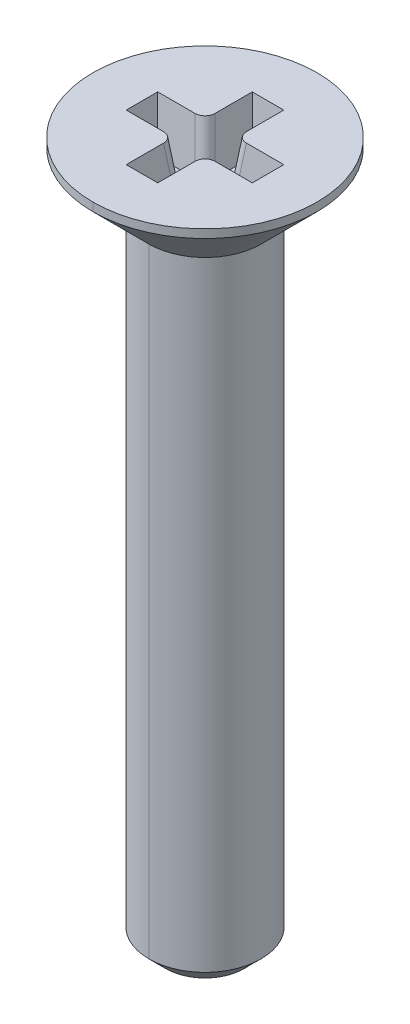
ISO-10303-21;
HEADER;
FILE_DESCRIPTION(('STEP AP214'),'2;1');
FILE_NAME('part.step','',(''),(''),'','','');
FILE_SCHEMA(('AUTOMOTIVE_DESIGN { 1 0 10303 214 1 1 1 1 }'));
ENDSEC;
DATA;
#1=APPLICATION_CONTEXT('core data for automotive mechanical design processes');
#2=APPLICATION_PROTOCOL_DEFINITION('international standard','automotive_design',2000,#1);
#3=PRODUCT_CONTEXT('',#1,'mechanical');
#4=PRODUCT('Part','Part','',(#3));
#5=PRODUCT_RELATED_PRODUCT_CATEGORY('part','',(#4));
#6=PRODUCT_DEFINITION_FORMATION('','',#4);
#7=PRODUCT_DEFINITION_CONTEXT('part definition',#1,'design');
#8=PRODUCT_DEFINITION('design','',#6,#7);
#9=PRODUCT_DEFINITION_SHAPE('','',#8);
#10=(LENGTH_UNIT() NAMED_UNIT(*) SI_UNIT(.MILLI.,.METRE.));
#11=(NAMED_UNIT(*) PLANE_ANGLE_UNIT() SI_UNIT($,.RADIAN.));
#12=(NAMED_UNIT(*) SI_UNIT($,.STERADIAN.) SOLID_ANGLE_UNIT());
#13=UNCERTAINTY_MEASURE_WITH_UNIT(LENGTH_MEASURE(1.E-05),#10,'distance_accuracy_value','');
#14=(GEOMETRIC_REPRESENTATION_CONTEXT(3) GLOBAL_UNCERTAINTY_ASSIGNED_CONTEXT((#13)) GLOBAL_UNIT_ASSIGNED_CONTEXT((#10,
#11,#12)) REPRESENTATION_CONTEXT('',''));
#15=CARTESIAN_POINT('',(0.,0.,0.));
#16=DIRECTION('',(0.,0.,1.));
#17=DIRECTION('',(1.,0.,0.));
#18=AXIS2_PLACEMENT_3D('',#15,#16,#17);
#19=CARTESIAN_POINT('',(-0.937327513708971,2.4151528831535,-0.937327513708973));
#20=DIRECTION('',(-0.120974291151355,0.985256536015293,-0.120974291151355));
#21=DIRECTION('',(0.,0.121869343405148,0.992546151641322));
#22=AXIS2_PLACEMENT_3D('',#19,#20,#21);
#23=CYLINDRICAL_SURFACE('',#22,0.358);
#24=CARTESIAN_POINT('',(-0.3427156359838,0.510000000000022,-0.698047158271395));
#25=CARTESIAN_POINT('',(-0.342715635983799,0.510000000000021,-0.489263624321907));
#26=CARTESIAN_POINT('',(-0.489263624321904,0.510000000000021,-0.342715635983802));
#27=CARTESIAN_POINT('',(-0.698047158271393,0.510000000000022,-0.342715635983802));
#28=(BOUNDED_CURVE() B_SPLINE_CURVE(3,(#24,#25,#26,#27),.UNSPECIFIED.,.F.,
.F.) B_SPLINE_CURVE_WITH_KNOTS((4,4),(2.36362083166487,3.91956447551472),
.UNSPECIFIED.) CURVE() GEOMETRIC_REPRESENTATION_ITEM() RATIONAL_B_SPLINE_CURVE((1.,
0.808225633839927,0.808225633839927,1.)) REPRESENTATION_ITEM(''));
#29=CARTESIAN_POINT('',(-0.3427156359838,0.510000000000022,-0.698047158271395));
#30=VERTEX_POINT('',#29);
#31=CARTESIAN_POINT('',(-0.698047158271393,0.510000000000022,-0.342715635983802));
#32=VERTEX_POINT('',#31);
#33=EDGE_CURVE('E354',#30,#32,#28,.T.);
#34=ORIENTED_EDGE('',*,*,#33,.F.);
#35=DIRECTION('',(0.120974291151355,-0.985256536015293,0.120974291151355));
#36=VECTOR('',#35,1.);
#37=CARTESIAN_POINT('',(-0.3375154376409,0.46764778320126,-0.692846959928494));
#38=LINE('',#37,#36);
#39=CARTESIAN_POINT('',(-0.5625,2.3,-0.917831522287595));
#40=VERTEX_POINT('',#39);
#41=EDGE_CURVE('E355',#40,#30,#38,.T.);
#42=ORIENTED_EDGE('',*,*,#41,.F.);
#43=CARTESIAN_POINT('',(-0.917831522287592,2.3,-0.5625));
#44=CARTESIAN_POINT('',(-0.709047988338105,2.30000000000002,-0.562500000000001));
#45=CARTESIAN_POINT('',(-0.562499999999999,2.30000000000002,-0.709047988338106));
#46=CARTESIAN_POINT('',(-0.5625,2.3,-0.917831522287595));
#47=(BOUNDED_CURVE() B_SPLINE_CURVE(3,(#43,#44,#45,#46),.UNSPECIFIED.,.F.,
.F.) B_SPLINE_CURVE_WITH_KNOTS((4,4),(2.36362083166487,3.91956447551472),
.UNSPECIFIED.) CURVE() GEOMETRIC_REPRESENTATION_ITEM() RATIONAL_B_SPLINE_CURVE((1.,
0.808225633839927,0.808225633839927,1.)) REPRESENTATION_ITEM(''));
#48=CARTESIAN_POINT('',(-0.917831522287592,2.3,-0.5625));
#49=VERTEX_POINT('',#48);
#50=EDGE_CURVE('E280',#49,#40,#47,.T.);
#51=ORIENTED_EDGE('',*,*,#50,.F.);
#52=DIRECTION('',(-0.120974291151355,0.985256536015293,-0.120974291151355));
#53=VECTOR('',#52,1.);
#54=CARTESIAN_POINT('',(-0.912631323944692,2.25764778320126,-0.557299801657101));
#55=LINE('',#54,#53);
#56=EDGE_CURVE('E10',#32,#49,#55,.T.);
#57=ORIENTED_EDGE('',*,*,#56,.F.);
#58=EDGE_LOOP('',(#34,#42,#51,#57));
#59=FACE_BOUND('',#58,.T.);
#60=ADVANCED_FACE('F16',(#59),#23,.T.);
#61=CARTESIAN_POINT('',(-0.871471007670894,1.87879468344341,0.871471007670896));
#62=DIRECTION('',(-0.120974291151355,0.985256536015293,0.120974291151355));
#63=DIRECTION('',(-0.992546151641322,-0.121869343405148,0.));
#64=AXIS2_PLACEMENT_3D('',#61,#62,#63);
#65=CYLINDRICAL_SURFACE('',#64,0.358);
#66=CARTESIAN_POINT('',(-0.698047158271394,0.510000000000022,0.342715635983802));
#67=CARTESIAN_POINT('',(-0.489263624321906,0.510000000000022,0.342715635983801));
#68=CARTESIAN_POINT('',(-0.342715635983801,0.510000000000022,0.489263624321906));
#69=CARTESIAN_POINT('',(-0.342715635983801,0.510000000000022,0.698047158271395));
#70=(BOUNDED_CURVE() B_SPLINE_CURVE(3,(#66,#67,#68,#69),.UNSPECIFIED.,.F.,
.F.) B_SPLINE_CURVE_WITH_KNOTS((4,4),(2.36362083166487,3.91956447551472),
.UNSPECIFIED.) CURVE() GEOMETRIC_REPRESENTATION_ITEM() RATIONAL_B_SPLINE_CURVE((1.,
0.808225633839927,0.808225633839927,1.)) REPRESENTATION_ITEM(''));
#71=CARTESIAN_POINT('',(-0.698047158271394,0.510000000000022,0.342715635983802));
#72=VERTEX_POINT('',#71);
#73=CARTESIAN_POINT('',(-0.342715635983801,0.510000000000022,0.698047158271395));
#74=VERTEX_POINT('',#73);
#75=EDGE_CURVE('E372',#72,#74,#70,.T.);
#76=ORIENTED_EDGE('',*,*,#75,.F.);
#77=DIRECTION('',(0.120974291151355,-0.985256536015293,-0.120974291151355));
#78=VECTOR('',#77,1.);
#79=CARTESIAN_POINT('',(-0.937327513708972,2.45878210809255,0.58199599142138));
#80=LINE('',#79,#78);
#81=CARTESIAN_POINT('',(-0.917831522287593,2.3,0.5625));
#82=VERTEX_POINT('',#81);
#83=EDGE_CURVE('E298',#82,#72,#80,.T.);
#84=ORIENTED_EDGE('',*,*,#83,.F.);
#85=CARTESIAN_POINT('',(-0.5625,2.3,0.917831522287594));
#86=CARTESIAN_POINT('',(-0.5625,2.30000000000002,0.709047988338106));
#87=CARTESIAN_POINT('',(-0.709047988338105,2.30000000000002,0.562500000000001));
#88=CARTESIAN_POINT('',(-0.917831522287593,2.3,0.5625));
#89=(BOUNDED_CURVE() B_SPLINE_CURVE(3,(#85,#86,#87,#88),.UNSPECIFIED.,.F.,
.F.) B_SPLINE_CURVE_WITH_KNOTS((4,4),(2.36362083166487,3.91956447551472),
.UNSPECIFIED.) CURVE() GEOMETRIC_REPRESENTATION_ITEM() RATIONAL_B_SPLINE_CURVE((1.,
0.808225633839927,0.808225633839927,1.)) REPRESENTATION_ITEM(''));
#90=CARTESIAN_POINT('',(-0.5625,2.3,0.917831522287594));
#91=VERTEX_POINT('',#90);
#92=EDGE_CURVE('E259',#91,#82,#89,.T.);
#93=ORIENTED_EDGE('',*,*,#92,.F.);
#94=DIRECTION('',(-0.120974291151355,0.985256536015293,0.120974291151355));
#95=VECTOR('',#94,1.);
#96=CARTESIAN_POINT('',(-0.516139485383301,1.92242390838245,0.871471007670896));
#97=LINE('',#96,#95);
#98=EDGE_CURVE('E335',#74,#91,#97,.T.);
#99=ORIENTED_EDGE('',*,*,#98,.F.);
#100=EDGE_LOOP('',(#76,#84,#93,#99));
#101=FACE_BOUND('',#100,.T.);
#102=ADVANCED_FACE('F496',(#101),#65,.T.);
#103=CARTESIAN_POINT('',(0.871471007670896,1.87879468344341,0.871471007670895));
#104=DIRECTION('',(0.120974291151355,0.985256536015293,0.120974291151355));
#105=DIRECTION('',(-0.992546151641322,0.121869343405148,0.));
#106=AXIS2_PLACEMENT_3D('',#103,#104,#105);
#107=CYLINDRICAL_SURFACE('',#106,0.358);
#108=CARTESIAN_POINT('',(0.342715635983802,0.510000000000022,0.698047158271395));
#109=CARTESIAN_POINT('',(0.342715635983802,0.510000000000022,0.489263624321907));
#110=CARTESIAN_POINT('',(0.489263624321907,0.510000000000022,0.342715635983802));
#111=CARTESIAN_POINT('',(0.698047158271395,0.510000000000022,0.342715635983802));
#112=(BOUNDED_CURVE() B_SPLINE_CURVE(3,(#108,#109,#110,#111),.UNSPECIFIED.,.F.,
.F.) B_SPLINE_CURVE_WITH_KNOTS((4,4),(2.36362083166487,3.91956447551472),
.UNSPECIFIED.) CURVE() GEOMETRIC_REPRESENTATION_ITEM() RATIONAL_B_SPLINE_CURVE((1.,
0.808225633839927,0.808225633839927,1.)) REPRESENTATION_ITEM(''));
#113=CARTESIAN_POINT('',(0.342715635983802,0.510000000000022,0.698047158271395));
#114=VERTEX_POINT('',#113);
#115=CARTESIAN_POINT('',(0.698047158271395,0.510000000000022,0.342715635983802));
#116=VERTEX_POINT('',#115);
#117=EDGE_CURVE('E377',#114,#116,#112,.T.);
#118=ORIENTED_EDGE('',*,*,#117,.F.);
#119=DIRECTION('',(-0.120974291151355,-0.985256536015293,-0.120974291151355));
#120=VECTOR('',#119,1.);
#121=CARTESIAN_POINT('',(0.337515437640901,0.46764778320126,0.692846959928494));
#122=LINE('',#121,#120);
#123=CARTESIAN_POINT('',(0.5625,2.3,0.917831522287594));
#124=VERTEX_POINT('',#123);
#125=EDGE_CURVE('E227',#124,#114,#122,.T.);
#126=ORIENTED_EDGE('',*,*,#125,.F.);
#127=CARTESIAN_POINT('',(0.917831522287594,2.3,0.5625));
#128=CARTESIAN_POINT('',(0.709047988338106,2.30000000000002,0.562500000000001));
#129=CARTESIAN_POINT('',(0.562500000000001,2.30000000000002,0.709047988338106));
#130=CARTESIAN_POINT('',(0.5625,2.3,0.917831522287594));
#131=(BOUNDED_CURVE() B_SPLINE_CURVE(3,(#127,#128,#129,#130),.UNSPECIFIED.,.F.,
.F.) B_SPLINE_CURVE_WITH_KNOTS((4,4),(2.36362083166487,3.91956447551472),
.UNSPECIFIED.) CURVE() GEOMETRIC_REPRESENTATION_ITEM() RATIONAL_B_SPLINE_CURVE((1.,
0.808225633839927,0.808225633839927,1.)) REPRESENTATION_ITEM(''));
#132=CARTESIAN_POINT('',(0.917831522287594,2.3,0.5625));
#133=VERTEX_POINT('',#132);
#134=EDGE_CURVE('E224',#133,#124,#131,.T.);
#135=ORIENTED_EDGE('',*,*,#134,.F.);
#136=DIRECTION('',(0.120974291151355,0.985256536015293,0.120974291151355));
#137=VECTOR('',#136,1.);
#138=CARTESIAN_POINT('',(0.912631323944694,2.25764778320126,0.557299801657101));
#139=LINE('',#138,#137);
#140=EDGE_CURVE('E210',#116,#133,#139,.T.);
#141=ORIENTED_EDGE('',*,*,#140,.F.);
#142=EDGE_LOOP('',(#118,#126,#135,#141));
#143=FACE_BOUND('',#142,.T.);
#144=ADVANCED_FACE('F225',(#143),#107,.T.);
#145=CARTESIAN_POINT('',(0.937327513708973,2.4151528831535,-0.937327513708973));
#146=DIRECTION('',(0.120974291151355,0.985256536015293,-0.120974291151355));
#147=DIRECTION('',(0.,0.121869343405148,0.992546151641322));
#148=AXIS2_PLACEMENT_3D('',#145,#146,#147);
#149=CYLINDRICAL_SURFACE('',#148,0.358);
#150=CARTESIAN_POINT('',(0.698047158271395,0.510000000000022,-0.342715635983802));
#151=CARTESIAN_POINT('',(0.489263624321907,0.510000000000021,-0.342715635983801));
#152=CARTESIAN_POINT('',(0.342715635983801,0.510000000000021,-0.489263624321907));
#153=CARTESIAN_POINT('',(0.342715635983802,0.510000000000022,-0.698047158271395));
#154=(BOUNDED_CURVE() B_SPLINE_CURVE(3,(#150,#151,#152,#153),.UNSPECIFIED.,.F.,
.F.) B_SPLINE_CURVE_WITH_KNOTS((4,4),(2.36362083166487,3.91956447551472),
.UNSPECIFIED.) CURVE() GEOMETRIC_REPRESENTATION_ITEM() RATIONAL_B_SPLINE_CURVE((1.,
0.808225633839927,0.808225633839927,1.)) REPRESENTATION_ITEM(''));
#155=CARTESIAN_POINT('',(0.698047158271395,0.510000000000022,-0.342715635983802));
#156=VERTEX_POINT('',#155);
#157=CARTESIAN_POINT('',(0.342715635983802,0.510000000000022,-0.698047158271395));
#158=VERTEX_POINT('',#157);
#159=EDGE_CURVE('E385',#156,#158,#154,.T.);
#160=ORIENTED_EDGE('',*,*,#159,.F.);
#161=DIRECTION('',(-0.120974291151355,-0.985256536015293,0.120974291151355));
#162=VECTOR('',#161,1.);
#163=CARTESIAN_POINT('',(0.871471007670895,1.92242390838245,-0.516139485383302));
#164=LINE('',#163,#162);
#165=CARTESIAN_POINT('',(0.917831522287594,2.3,-0.5625));
#166=VERTEX_POINT('',#165);
#167=EDGE_CURVE('E37',#166,#156,#164,.T.);
#168=ORIENTED_EDGE('',*,*,#167,.F.);
#169=CARTESIAN_POINT('',(0.5625,2.3,-0.917831522287594));
#170=CARTESIAN_POINT('',(0.562500000000001,2.30000000000002,-0.709047988338106));
#171=CARTESIAN_POINT('',(0.709047988338106,2.30000000000002,-0.562500000000001));
#172=CARTESIAN_POINT('',(0.917831522287594,2.3,-0.5625));
#173=(BOUNDED_CURVE() B_SPLINE_CURVE(3,(#169,#170,#171,#172),.UNSPECIFIED.,.F.,
.F.) B_SPLINE_CURVE_WITH_KNOTS((4,4),(2.36362083166487,3.91956447551472),
.UNSPECIFIED.) CURVE() GEOMETRIC_REPRESENTATION_ITEM() RATIONAL_B_SPLINE_CURVE((1.,
0.808225633839927,0.808225633839927,1.)) REPRESENTATION_ITEM(''));
#174=CARTESIAN_POINT('',(0.5625,2.3,-0.917831522287594));
#175=VERTEX_POINT('',#174);
#176=EDGE_CURVE('E449',#175,#166,#173,.T.);
#177=ORIENTED_EDGE('',*,*,#176,.F.);
#178=DIRECTION('',(0.120974291151355,0.985256536015293,-0.120974291151355));
#179=VECTOR('',#178,1.);
#180=CARTESIAN_POINT('',(0.58199599142138,2.45878210809255,-0.937327513708973));
#181=LINE('',#180,#179);
#182=EDGE_CURVE('E309',#158,#175,#181,.T.);
#183=ORIENTED_EDGE('',*,*,#182,.F.);
#184=EDGE_LOOP('',(#160,#168,#177,#183));
#185=FACE_BOUND('',#184,.T.);
#186=ADVANCED_FACE('F598',(#185),#149,.T.);
#187=CARTESIAN_POINT('',(0.,-22.1,0.));
#188=DIRECTION('',(0.,1.,0.));
#189=DIRECTION('',(0.,0.,1.));
#190=AXIS2_PLACEMENT_3D('',#187,#188,#189);
#191=CONICAL_SURFACE('',#190,2.,0.785398163397453);
#192=DIRECTION('',(0.,0.707106781186544,-0.707106781186552));
#193=VECTOR('',#192,1.);
#194=CARTESIAN_POINT('',(0.,-22.1,-2.));
#195=LINE('',#194,#193);
#196=CARTESIAN_POINT('',(0.,-22.7,-1.4));
#197=VERTEX_POINT('',#196);
#198=CARTESIAN_POINT('',(0.,-22.1,-2.));
#199=VERTEX_POINT('',#198);
#200=EDGE_CURVE('E532',#197,#199,#195,.T.);
#201=ORIENTED_EDGE('',*,*,#200,.F.);
#202=CARTESIAN_POINT('',(0.,-22.7,0.));
#203=DIRECTION('',(0.,-1.,0.));
#204=DIRECTION('',(0.,0.,1.));
#205=AXIS2_PLACEMENT_3D('',#202,#203,#204);
#206=CIRCLE('',#205,1.4);
#207=CARTESIAN_POINT('',(0.,-22.7,1.4));
#208=VERTEX_POINT('',#207);
#209=EDGE_CURVE('E254',#208,#197,#206,.T.);
#210=ORIENTED_EDGE('',*,*,#209,.F.);
#211=DIRECTION('',(0.,0.707106781186544,0.707106781186552));
#212=VECTOR('',#211,1.);
#213=CARTESIAN_POINT('',(0.,-22.1,2.));
#214=LINE('',#213,#212);
#215=CARTESIAN_POINT('',(0.,-22.1,2.));
#216=VERTEX_POINT('',#215);
#217=EDGE_CURVE('E522',#208,#216,#214,.T.);
#218=ORIENTED_EDGE('',*,*,#217,.T.);
#219=CARTESIAN_POINT('',(0.,-22.1,0.));
#220=DIRECTION('',(0.,1.,0.));
#221=DIRECTION('',(0.,0.,1.));
#222=AXIS2_PLACEMENT_3D('',#219,#220,#221);
#223=CIRCLE('',#222,2.);
#224=EDGE_CURVE('E313',#199,#216,#223,.T.);
#225=ORIENTED_EDGE('',*,*,#224,.F.);
#226=EDGE_LOOP('',(#201,#210,#218,#225));
#227=FACE_BOUND('',#226,.T.);
#228=ADVANCED_FACE('F591',(#227),#191,.T.);
#229=CARTESIAN_POINT('',(-2.25,2.3,-0.5625));
#230=DIRECTION('',(0.,-0.121869343405148,-0.992546151641322));
#231=DIRECTION('',(0.,-0.992546151641322,0.121869343405148));
#232=AXIS2_PLACEMENT_3D('',#229,#230,#231);
#233=PLANE('',#232);
#234=DIRECTION('',(1.,0.,0.));
#235=VECTOR('',#234,1.);
#236=CARTESIAN_POINT('',(-2.25,0.510000000000022,-0.342715635983802));
#237=LINE('',#236,#235);
#238=CARTESIAN_POINT('',(-2.0302156359838,0.510000000000022,-0.342715635983802));
#239=VERTEX_POINT('',#238);
#240=EDGE_CURVE('E344',#239,#32,#237,.T.);
#241=ORIENTED_EDGE('',*,*,#240,.T.);
#242=ORIENTED_EDGE('',*,*,#56,.T.);
#243=DIRECTION('',(1.,0.,0.));
#244=VECTOR('',#243,1.);
#245=CARTESIAN_POINT('',(-2.25,2.3,-0.5625));
#246=LINE('',#245,#244);
#247=CARTESIAN_POINT('',(-2.25,2.3,-0.5625));
#248=VERTEX_POINT('',#247);
#249=EDGE_CURVE('E276',#248,#49,#246,.T.);
#250=ORIENTED_EDGE('',*,*,#249,.F.);
#251=DIRECTION('',(-0.120974291151354,0.985256536015293,-0.120974291151355));
#252=VECTOR('',#251,1.);
#253=CARTESIAN_POINT('',(-2.25,2.3,-0.5625));
#254=LINE('',#253,#252);
#255=EDGE_CURVE('E24',#239,#248,#254,.T.);
#256=ORIENTED_EDGE('',*,*,#255,.F.);
#257=EDGE_LOOP('',(#241,#242,#250,#256));
#258=FACE_BOUND('',#257,.T.);
#259=ADVANCED_FACE('F583',(#258),#233,.F.);
#260=CARTESIAN_POINT('',(-2.25,2.3,-0.5625));
#261=DIRECTION('',(-0.992546151641322,-0.121869343405148,0.));
#262=DIRECTION('',(-0.121869343405148,0.992546151641322,0.));
#263=AXIS2_PLACEMENT_3D('',#260,#261,#262);
#264=PLANE('',#263);
#265=DIRECTION('',(0.,0.,1.));
#266=VECTOR('',#265,1.);
#267=CARTESIAN_POINT('',(-2.25,2.3,-0.5625));
#268=LINE('',#267,#266);
#269=CARTESIAN_POINT('',(-2.25,2.3,0.5625));
#270=VERTEX_POINT('',#269);
#271=EDGE_CURVE('E272',#248,#270,#268,.T.);
#272=ORIENTED_EDGE('',*,*,#271,.T.);
#273=DIRECTION('',(-0.120974291151356,0.985256536015293,0.120974291151355));
#274=VECTOR('',#273,1.);
#275=CARTESIAN_POINT('',(-2.23353587349048,2.1659104500725,0.546035873490482));
#276=LINE('',#275,#274);
#277=CARTESIAN_POINT('',(-2.0302156359838,0.510000000000022,0.342715635983802));
#278=VERTEX_POINT('',#277);
#279=EDGE_CURVE('E301',#278,#270,#276,.T.);
#280=ORIENTED_EDGE('',*,*,#279,.F.);
#281=DIRECTION('',(0.,0.,1.));
#282=VECTOR('',#281,1.);
#283=CARTESIAN_POINT('',(-2.0302156359838,0.510000000000022,-0.5625));
#284=LINE('',#283,#282);
#285=EDGE_CURVE('E339',#239,#278,#284,.T.);
#286=ORIENTED_EDGE('',*,*,#285,.F.);
#287=ORIENTED_EDGE('',*,*,#255,.T.);
#288=EDGE_LOOP('',(#272,#280,#286,#287));
#289=FACE_BOUND('',#288,.T.);
#290=ADVANCED_FACE('F581',(#289),#264,.F.);
#291=CARTESIAN_POINT('',(-2.25,2.3,0.5625));
#292=DIRECTION('',(0.,-0.121869343405148,0.992546151641322));
#293=DIRECTION('',(-1.,0.,0.));
#294=AXIS2_PLACEMENT_3D('',#291,#292,#293);
#295=PLANE('',#294);
#296=DIRECTION('',(1.,0.,0.));
#297=VECTOR('',#296,1.);
#298=CARTESIAN_POINT('',(-2.25,2.3,0.5625));
#299=LINE('',#298,#297);
#300=EDGE_CURVE('E265',#270,#82,#299,.T.);
#301=ORIENTED_EDGE('',*,*,#300,.T.);
#302=ORIENTED_EDGE('',*,*,#83,.T.);
#303=DIRECTION('',(1.,0.,0.));
#304=VECTOR('',#303,1.);
#305=CARTESIAN_POINT('',(-2.25,0.510000000000022,0.342715635983802));
#306=LINE('',#305,#304);
#307=EDGE_CURVE('E343',#278,#72,#306,.T.);
#308=ORIENTED_EDGE('',*,*,#307,.F.);
#309=ORIENTED_EDGE('',*,*,#279,.T.);
#310=EDGE_LOOP('',(#301,#302,#308,#309));
#311=FACE_BOUND('',#310,.T.);
#312=ADVANCED_FACE('F580',(#311),#295,.F.);
#313=CARTESIAN_POINT('',(-2.25,2.3,-0.5625));
#314=DIRECTION('',(0.,-0.121869343405148,-0.992546151641322));
#315=DIRECTION('',(0.,-0.992546151641322,0.121869343405148));
#316=AXIS2_PLACEMENT_3D('',#313,#314,#315);
#317=PLANE('',#316);
#318=DIRECTION('',(1.,0.,0.));
#319=VECTOR('',#318,1.);
#320=CARTESIAN_POINT('',(-2.25,2.3,-0.5625));
#321=LINE('',#320,#319);
#322=CARTESIAN_POINT('',(2.25,2.3,-0.5625));
#323=VERTEX_POINT('',#322);
#324=EDGE_CURVE('E245',#166,#323,#321,.T.);
#325=ORIENTED_EDGE('',*,*,#324,.F.);
#326=ORIENTED_EDGE('',*,*,#167,.T.);
#327=DIRECTION('',(1.,0.,0.));
#328=VECTOR('',#327,1.);
#329=CARTESIAN_POINT('',(-2.25,0.510000000000022,-0.342715635983802));
#330=LINE('',#329,#328);
#331=CARTESIAN_POINT('',(2.0302156359838,0.510000000000022,-0.342715635983802));
#332=VERTEX_POINT('',#331);
#333=EDGE_CURVE('E317',#156,#332,#330,.T.);
#334=ORIENTED_EDGE('',*,*,#333,.T.);
#335=DIRECTION('',(0.120974291151354,0.985256536015293,-0.120974291151355));
#336=VECTOR('',#335,1.);
#337=CARTESIAN_POINT('',(2.25,2.3,-0.5625));
#338=LINE('',#337,#336);
#339=EDGE_CURVE('E48',#332,#323,#338,.T.);
#340=ORIENTED_EDGE('',*,*,#339,.T.);
#341=EDGE_LOOP('',(#325,#326,#334,#340));
#342=FACE_BOUND('',#341,.T.);
#343=ADVANCED_FACE('F589',(#342),#317,.F.);
#344=CARTESIAN_POINT('',(-2.25,2.3,0.5625));
#345=DIRECTION('',(0.,-0.121869343405148,0.992546151641322));
#346=DIRECTION('',(-1.,0.,0.));
#347=AXIS2_PLACEMENT_3D('',#344,#345,#346);
#348=PLANE('',#347);
#349=DIRECTION('',(1.,0.,0.));
#350=VECTOR('',#349,1.);
#351=CARTESIAN_POINT('',(-2.25,0.510000000000022,0.342715635983802));
#352=LINE('',#351,#350);
#353=CARTESIAN_POINT('',(2.0302156359838,0.510000000000022,0.342715635983802));
#354=VERTEX_POINT('',#353);
#355=EDGE_CURVE('E217',#116,#354,#352,.T.);
#356=ORIENTED_EDGE('',*,*,#355,.F.);
#357=ORIENTED_EDGE('',*,*,#140,.T.);
#358=DIRECTION('',(1.,0.,0.));
#359=VECTOR('',#358,1.);
#360=CARTESIAN_POINT('',(-2.25,2.3,0.5625));
#361=LINE('',#360,#359);
#362=CARTESIAN_POINT('',(2.25,2.3,0.5625));
#363=VERTEX_POINT('',#362);
#364=EDGE_CURVE('E214',#133,#363,#361,.T.);
#365=ORIENTED_EDGE('',*,*,#364,.T.);
#366=DIRECTION('',(0.120974291151355,0.985256536015293,0.120974291151355));
#367=VECTOR('',#366,1.);
#368=CARTESIAN_POINT('',(2.23353587349048,2.1659104500725,0.546035873490482));
#369=LINE('',#368,#367);
#370=EDGE_CURVE('E221',#354,#363,#369,.T.);
#371=ORIENTED_EDGE('',*,*,#370,.F.);
#372=EDGE_LOOP('',(#356,#357,#365,#371));
#373=FACE_BOUND('',#372,.T.);
#374=ADVANCED_FACE('F212',(#373),#348,.F.);
#375=CARTESIAN_POINT('',(2.25,2.3,-0.5625));
#376=DIRECTION('',(0.992546151641322,-0.121869343405148,0.));
#377=DIRECTION('',(0.,0.,-1.));
#378=AXIS2_PLACEMENT_3D('',#375,#376,#377);
#379=PLANE('',#378);
#380=DIRECTION('',(0.,0.,1.));
#381=VECTOR('',#380,1.);
#382=CARTESIAN_POINT('',(2.25,2.3,-0.5625));
#383=LINE('',#382,#381);
#384=EDGE_CURVE('E238',#323,#363,#383,.T.);
#385=ORIENTED_EDGE('',*,*,#384,.F.);
#386=ORIENTED_EDGE('',*,*,#339,.F.);
#387=DIRECTION('',(0.,0.,1.));
#388=VECTOR('',#387,1.);
#389=CARTESIAN_POINT('',(2.0302156359838,0.510000000000022,-0.5625));
#390=LINE('',#389,#388);
#391=EDGE_CURVE('E314',#332,#354,#390,.T.);
#392=ORIENTED_EDGE('',*,*,#391,.T.);
#393=ORIENTED_EDGE('',*,*,#370,.T.);
#394=EDGE_LOOP('',(#385,#386,#392,#393));
#395=FACE_BOUND('',#394,.T.);
#396=ADVANCED_FACE('F658',(#395),#379,.F.);
#397=CARTESIAN_POINT('',(0.5625,0.510000000000022,-2.25));
#398=DIRECTION('',(0.,-1.,0.));
#399=DIRECTION('',(0.,0.,-1.));
#400=AXIS2_PLACEMENT_3D('',#397,#398,#399);
#401=PLANE('',#400);
#402=DIRECTION('',(0.,0.,1.));
#403=VECTOR('',#402,1.);
#404=CARTESIAN_POINT('',(0.342715635983801,0.510000000000022,-2.25));
#405=LINE('',#404,#403);
#406=CARTESIAN_POINT('',(0.342715635983801,0.510000000000022,-2.0302156359838));
#407=VERTEX_POINT('',#406);
#408=EDGE_CURVE('E305',#407,#158,#405,.T.);
#409=ORIENTED_EDGE('',*,*,#408,.F.);
#410=DIRECTION('',(1.,0.,0.));
#411=VECTOR('',#410,1.);
#412=CARTESIAN_POINT('',(-0.5625,0.510000000000022,-2.0302156359838));
#413=LINE('',#412,#411);
#414=CARTESIAN_POINT('',(-0.3427156359838,0.510000000000022,-2.0302156359838));
#415=VERTEX_POINT('',#414);
#416=EDGE_CURVE('E347',#415,#407,#413,.T.);
#417=ORIENTED_EDGE('',*,*,#416,.F.);
#418=DIRECTION('',(0.,0.,1.));
#419=VECTOR('',#418,1.);
#420=CARTESIAN_POINT('',(-0.3427156359838,0.510000000000022,-2.25));
#421=LINE('',#420,#419);
#422=EDGE_CURVE('E350',#415,#30,#421,.T.);
#423=ORIENTED_EDGE('',*,*,#422,.T.);
#424=ORIENTED_EDGE('',*,*,#33,.T.);
#425=ORIENTED_EDGE('',*,*,#240,.F.);
#426=ORIENTED_EDGE('',*,*,#285,.T.);
#427=ORIENTED_EDGE('',*,*,#307,.T.);
#428=ORIENTED_EDGE('',*,*,#75,.T.);
#429=DIRECTION('',(0.,0.,1.));
#430=VECTOR('',#429,1.);
#431=CARTESIAN_POINT('',(-0.3427156359838,0.510000000000022,-2.25));
#432=LINE('',#431,#430);
#433=CARTESIAN_POINT('',(-0.342715635983801,0.510000000000022,2.0302156359838));
#434=VERTEX_POINT('',#433);
#435=EDGE_CURVE('E332',#74,#434,#432,.T.);
#436=ORIENTED_EDGE('',*,*,#435,.T.);
#437=DIRECTION('',(1.,0.,0.));
#438=VECTOR('',#437,1.);
#439=CARTESIAN_POINT('',(-0.5625,0.510000000000022,2.0302156359838));
#440=LINE('',#439,#438);
#441=CARTESIAN_POINT('',(0.342715635983802,0.510000000000022,2.0302156359838));
#442=VERTEX_POINT('',#441);
#443=EDGE_CURVE('E326',#434,#442,#440,.T.);
#444=ORIENTED_EDGE('',*,*,#443,.T.);
#445=DIRECTION('',(0.,0.,1.));
#446=VECTOR('',#445,1.);
#447=CARTESIAN_POINT('',(0.342715635983801,0.510000000000022,-2.25));
#448=LINE('',#447,#446);
#449=EDGE_CURVE('E253',#114,#442,#448,.T.);
#450=ORIENTED_EDGE('',*,*,#449,.F.);
#451=ORIENTED_EDGE('',*,*,#117,.T.);
#452=ORIENTED_EDGE('',*,*,#355,.T.);
#453=ORIENTED_EDGE('',*,*,#391,.F.);
#454=ORIENTED_EDGE('',*,*,#333,.F.);
#455=ORIENTED_EDGE('',*,*,#159,.T.);
#456=EDGE_LOOP('',(#409,#417,#423,#424,#425,#426,#427,#428,#436,#444,#450,#451,#452,#453,#454,#455));
#457=FACE_BOUND('',#456,.T.);
#458=ADVANCED_FACE('F507',(#457),#401,.F.);
#459=CARTESIAN_POINT('',(-0.5625,2.3,-2.25));
#460=DIRECTION('',(-0.992546151641322,-0.121869343405148,0.));
#461=DIRECTION('',(-0.121869343405148,0.992546151641322,0.));
#462=AXIS2_PLACEMENT_3D('',#459,#460,#461);
#463=PLANE('',#462);
#464=DIRECTION('',(0.,0.,1.));
#465=VECTOR('',#464,1.);
#466=CARTESIAN_POINT('',(-0.5625,2.3,-2.25));
#467=LINE('',#466,#465);
#468=CARTESIAN_POINT('',(-0.5625,2.3,-2.25));
#469=VERTEX_POINT('',#468);
#470=EDGE_CURVE('E281',#469,#40,#467,.T.);
#471=ORIENTED_EDGE('',*,*,#470,.T.);
#472=ORIENTED_EDGE('',*,*,#41,.T.);
#473=ORIENTED_EDGE('',*,*,#422,.F.);
#474=DIRECTION('',(-0.120974291151355,0.985256536015293,-0.120974291151355));
#475=VECTOR('',#474,1.);
#476=CARTESIAN_POINT('',(-0.5625,2.3,-2.25));
#477=LINE('',#476,#475);
#478=EDGE_CURVE('E338',#415,#469,#477,.T.);
#479=ORIENTED_EDGE('',*,*,#478,.T.);
#480=EDGE_LOOP('',(#471,#472,#473,#479));
#481=FACE_BOUND('',#480,.T.);
#482=ADVANCED_FACE('F510',(#481),#463,.F.);
#483=CARTESIAN_POINT('',(0.5625,2.3,-2.25));
#484=DIRECTION('',(0.992546151641322,-0.121869343405148,0.));
#485=DIRECTION('',(0.,0.,-1.));
#486=AXIS2_PLACEMENT_3D('',#483,#484,#485);
#487=PLANE('',#486);
#488=ORIENTED_EDGE('',*,*,#408,.T.);
#489=ORIENTED_EDGE('',*,*,#182,.T.);
#490=DIRECTION('',(0.,0.,1.));
#491=VECTOR('',#490,1.);
#492=CARTESIAN_POINT('',(0.5625,2.3,-2.25));
#493=LINE('',#492,#491);
#494=CARTESIAN_POINT('',(0.5625,2.3,-2.25));
#495=VERTEX_POINT('',#494);
#496=EDGE_CURVE('E416',#495,#175,#493,.T.);
#497=ORIENTED_EDGE('',*,*,#496,.F.);
#498=DIRECTION('',(0.120974291151355,0.985256536015293,-0.120974291151355));
#499=VECTOR('',#498,1.);
#500=CARTESIAN_POINT('',(0.5625,2.3,-2.25));
#501=LINE('',#500,#499);
#502=EDGE_CURVE('E310',#407,#495,#501,.T.);
#503=ORIENTED_EDGE('',*,*,#502,.F.);
#504=EDGE_LOOP('',(#488,#489,#497,#503));
#505=FACE_BOUND('',#504,.T.);
#506=ADVANCED_FACE('F687',(#505),#487,.F.);
#507=CARTESIAN_POINT('',(-0.5625,2.3,-2.25));
#508=DIRECTION('',(0.,-0.121869343405148,-0.992546151641322));
#509=DIRECTION('',(0.,-0.992546151641322,0.121869343405148));
#510=AXIS2_PLACEMENT_3D('',#507,#508,#509);
#511=PLANE('',#510);
#512=DIRECTION('',(1.,0.,0.));
#513=VECTOR('',#512,1.);
#514=CARTESIAN_POINT('',(-0.5625,2.3,-2.25));
#515=LINE('',#514,#513);
#516=EDGE_CURVE('E285',#469,#495,#515,.T.);
#517=ORIENTED_EDGE('',*,*,#516,.F.);
#518=ORIENTED_EDGE('',*,*,#478,.F.);
#519=ORIENTED_EDGE('',*,*,#416,.T.);
#520=ORIENTED_EDGE('',*,*,#502,.T.);
#521=EDGE_LOOP('',(#517,#518,#519,#520));
#522=FACE_BOUND('',#521,.T.);
#523=ADVANCED_FACE('F697',(#522),#511,.F.);
#524=CARTESIAN_POINT('',(-0.5625,2.3,-2.25));
#525=DIRECTION('',(-0.992546151641322,-0.121869343405148,0.));
#526=DIRECTION('',(-0.121869343405148,0.992546151641322,0.));
#527=AXIS2_PLACEMENT_3D('',#524,#525,#526);
#528=PLANE('',#527);
#529=ORIENTED_EDGE('',*,*,#435,.F.);
#530=ORIENTED_EDGE('',*,*,#98,.T.);
#531=DIRECTION('',(0.,0.,1.));
#532=VECTOR('',#531,1.);
#533=CARTESIAN_POINT('',(-0.5625,2.3,-2.25));
#534=LINE('',#533,#532);
#535=CARTESIAN_POINT('',(-0.5625,2.3,2.25));
#536=VERTEX_POINT('',#535);
#537=EDGE_CURVE('E255',#91,#536,#534,.T.);
#538=ORIENTED_EDGE('',*,*,#537,.T.);
#539=DIRECTION('',(-0.120974291151355,0.985256536015293,0.120974291151355));
#540=VECTOR('',#539,1.);
#541=CARTESIAN_POINT('',(-0.496643493961923,1.76364180028992,2.18414349396192));
#542=LINE('',#541,#540);
#543=EDGE_CURVE('E329',#434,#536,#542,.T.);
#544=ORIENTED_EDGE('',*,*,#543,.F.);
#545=EDGE_LOOP('',(#529,#530,#538,#544));
#546=FACE_BOUND('',#545,.T.);
#547=ADVANCED_FACE('F574',(#546),#528,.F.);
#548=CARTESIAN_POINT('',(-0.5625,2.3,2.25));
#549=DIRECTION('',(0.,-0.121869343405148,0.992546151641322));
#550=DIRECTION('',(-1.,0.,0.));
#551=AXIS2_PLACEMENT_3D('',#548,#549,#550);
#552=PLANE('',#551);
#553=DIRECTION('',(1.,0.,0.));
#554=VECTOR('',#553,1.);
#555=CARTESIAN_POINT('',(-0.5625,2.3,2.25));
#556=LINE('',#555,#554);
#557=CARTESIAN_POINT('',(0.5625,2.3,2.25));
#558=VERTEX_POINT('',#557);
#559=EDGE_CURVE('E250',#536,#558,#556,.T.);
#560=ORIENTED_EDGE('',*,*,#559,.T.);
#561=DIRECTION('',(0.120974291151355,0.985256536015293,0.120974291151355));
#562=VECTOR('',#561,1.);
#563=CARTESIAN_POINT('',(0.496643493961924,1.76364180028992,2.18414349396192));
#564=LINE('',#563,#562);
#565=EDGE_CURVE('E323',#442,#558,#564,.T.);
#566=ORIENTED_EDGE('',*,*,#565,.F.);
#567=ORIENTED_EDGE('',*,*,#443,.F.);
#568=ORIENTED_EDGE('',*,*,#543,.T.);
#569=EDGE_LOOP('',(#560,#566,#567,#568));
#570=FACE_BOUND('',#569,.T.);
#571=ADVANCED_FACE('F570',(#570),#552,.F.);
#572=CARTESIAN_POINT('',(0.5625,2.3,-2.25));
#573=DIRECTION('',(0.992546151641322,-0.121869343405148,0.));
#574=DIRECTION('',(0.,0.,-1.));
#575=AXIS2_PLACEMENT_3D('',#572,#573,#574);
#576=PLANE('',#575);
#577=DIRECTION('',(0.,0.,1.));
#578=VECTOR('',#577,1.);
#579=CARTESIAN_POINT('',(0.5625,2.3,-2.25));
#580=LINE('',#579,#578);
#581=EDGE_CURVE('E232',#124,#558,#580,.T.);
#582=ORIENTED_EDGE('',*,*,#581,.F.);
#583=ORIENTED_EDGE('',*,*,#125,.T.);
#584=ORIENTED_EDGE('',*,*,#449,.T.);
#585=ORIENTED_EDGE('',*,*,#565,.T.);
#586=EDGE_LOOP('',(#582,#583,#584,#585));
#587=FACE_BOUND('',#586,.T.);
#588=ADVANCED_FACE('F566',(#587),#576,.F.);
#589=CARTESIAN_POINT('',(2.,-22.7,0.));
#590=DIRECTION('',(0.,1.,0.));
#591=DIRECTION('',(1.,0.,0.));
#592=AXIS2_PLACEMENT_3D('',#589,#590,#591);
#593=PLANE('',#592);
#594=ORIENTED_EDGE('',*,*,#209,.T.);
#595=CARTESIAN_POINT('',(0.,-22.7,0.));
#596=DIRECTION('',(0.,-1.,0.));
#597=DIRECTION('',(0.,0.,1.));
#598=AXIS2_PLACEMENT_3D('',#595,#596,#597);
#599=CIRCLE('',#598,1.4);
#600=EDGE_CURVE('E539',#197,#208,#599,.T.);
#601=ORIENTED_EDGE('',*,*,#600,.T.);
#602=EDGE_LOOP('',(#594,#601));
#603=FACE_BOUND('',#602,.T.);
#604=ADVANCED_FACE('F737',(#603),#593,.F.);
#605=CARTESIAN_POINT('',(0.,1.98375015365526,0.));
#606=DIRECTION('',(0.,1.,0.));
#607=DIRECTION('',(0.,0.,1.));
#608=AXIS2_PLACEMENT_3D('',#605,#606,#607);
#609=CYLINDRICAL_SURFACE('',#608,2.);
#610=DIRECTION('',(0.,1.,0.));
#611=VECTOR('',#610,1.);
#612=CARTESIAN_POINT('',(0.,1.98375015365526,-2.));
#613=LINE('',#612,#611);
#614=CARTESIAN_POINT('',(0.,0.,-2.));
#615=VERTEX_POINT('',#614);
#616=EDGE_CURVE('E465',#199,#615,#613,.T.);
#617=ORIENTED_EDGE('',*,*,#616,.F.);
#618=ORIENTED_EDGE('',*,*,#224,.T.);
#619=DIRECTION('',(0.,1.,0.));
#620=VECTOR('',#619,1.);
#621=CARTESIAN_POINT('',(0.,1.98375015365526,2.));
#622=LINE('',#621,#620);
#623=CARTESIAN_POINT('',(0.,0.,2.));
#624=VERTEX_POINT('',#623);
#625=EDGE_CURVE('E418',#216,#624,#622,.T.);
#626=ORIENTED_EDGE('',*,*,#625,.T.);
#627=CARTESIAN_POINT('',(0.,0.,0.));
#628=DIRECTION('',(0.,1.,0.));
#629=DIRECTION('',(0.,0.,1.));
#630=AXIS2_PLACEMENT_3D('',#627,#628,#629);
#631=CIRCLE('',#630,2.);
#632=EDGE_CURVE('E304',#615,#624,#631,.T.);
#633=ORIENTED_EDGE('',*,*,#632,.F.);
#634=EDGE_LOOP('',(#617,#618,#626,#633));
#635=FACE_BOUND('',#634,.T.);
#636=ADVANCED_FACE('F747',(#635),#609,.T.);
#637=CARTESIAN_POINT('',(0.,0.,0.));
#638=DIRECTION('',(0.,1.,0.));
#639=DIRECTION('',(0.,0.,1.));
#640=AXIS2_PLACEMENT_3D('',#637,#638,#639);
#641=CONICAL_SURFACE('',#640,2.,0.785398163397443);
#642=DIRECTION('',(0.,0.707106781186552,-0.707106781186544));
#643=VECTOR('',#642,1.);
#644=CARTESIAN_POINT('',(0.,0.,-2.));
#645=LINE('',#644,#643);
#646=CARTESIAN_POINT('',(0.,2.,-4.));
#647=VERTEX_POINT('',#646);
#648=EDGE_CURVE('E422',#615,#647,#645,.T.);
#649=ORIENTED_EDGE('',*,*,#648,.F.);
#650=ORIENTED_EDGE('',*,*,#632,.T.);
#651=DIRECTION('',(0.,0.707106781186552,0.707106781186544));
#652=VECTOR('',#651,1.);
#653=CARTESIAN_POINT('',(0.,0.,2.));
#654=LINE('',#653,#652);
#655=CARTESIAN_POINT('',(0.,2.,4.));
#656=VERTEX_POINT('',#655);
#657=EDGE_CURVE('E442',#624,#656,#654,.T.);
#658=ORIENTED_EDGE('',*,*,#657,.T.);
#659=CARTESIAN_POINT('',(0.,2.,0.));
#660=DIRECTION('',(0.,1.,0.));
#661=DIRECTION('',(0.,0.,1.));
#662=AXIS2_PLACEMENT_3D('',#659,#660,#661);
#663=CIRCLE('',#662,4.);
#664=EDGE_CURVE('E297',#647,#656,#663,.T.);
#665=ORIENTED_EDGE('',*,*,#664,.F.);
#666=EDGE_LOOP('',(#649,#650,#658,#665));
#667=FACE_BOUND('',#666,.T.);
#668=ADVANCED_FACE('F491',(#667),#641,.T.);
#669=CARTESIAN_POINT('',(0.,1.98375015365526,0.));
#670=DIRECTION('',(0.,1.,0.));
#671=DIRECTION('',(0.,0.,1.));
#672=AXIS2_PLACEMENT_3D('',#669,#670,#671);
#673=CYLINDRICAL_SURFACE('',#672,4.);
#674=DIRECTION('',(0.,1.,0.));
#675=VECTOR('',#674,1.);
#676=CARTESIAN_POINT('',(0.,1.98375015365526,-4.));
#677=LINE('',#676,#675);
#678=CARTESIAN_POINT('',(0.,2.3,-4.));
#679=VERTEX_POINT('',#678);
#680=EDGE_CURVE('E434',#647,#679,#677,.T.);
#681=ORIENTED_EDGE('',*,*,#680,.F.);
#682=ORIENTED_EDGE('',*,*,#664,.T.);
#683=DIRECTION('',(0.,1.,0.));
#684=VECTOR('',#683,1.);
#685=CARTESIAN_POINT('',(0.,1.98375015365526,4.));
#686=LINE('',#685,#684);
#687=CARTESIAN_POINT('',(0.,2.3,4.));
#688=VERTEX_POINT('',#687);
#689=EDGE_CURVE('E417',#656,#688,#686,.T.);
#690=ORIENTED_EDGE('',*,*,#689,.T.);
#691=CARTESIAN_POINT('',(0.,2.3,0.));
#692=DIRECTION('',(0.,1.,0.));
#693=DIRECTION('',(0.,0.,1.));
#694=AXIS2_PLACEMENT_3D('',#691,#692,#693);
#695=CIRCLE('',#694,4.);
#696=EDGE_CURVE('E414',#679,#688,#695,.T.);
#697=ORIENTED_EDGE('',*,*,#696,.F.);
#698=EDGE_LOOP('',(#681,#682,#690,#697));
#699=FACE_BOUND('',#698,.T.);
#700=ADVANCED_FACE('F477',(#699),#673,.T.);
#701=CARTESIAN_POINT('',(0.,2.3,0.));
#702=DIRECTION('',(0.,-1.,0.));
#703=DIRECTION('',(0.,0.,-1.));
#704=AXIS2_PLACEMENT_3D('',#701,#702,#703);
#705=PLANE('',#704);
#706=ORIENTED_EDGE('',*,*,#496,.T.);
#707=ORIENTED_EDGE('',*,*,#176,.T.);
#708=ORIENTED_EDGE('',*,*,#324,.T.);
#709=ORIENTED_EDGE('',*,*,#384,.T.);
#710=ORIENTED_EDGE('',*,*,#364,.F.);
#711=ORIENTED_EDGE('',*,*,#134,.T.);
#712=ORIENTED_EDGE('',*,*,#581,.T.);
#713=ORIENTED_EDGE('',*,*,#559,.F.);
#714=ORIENTED_EDGE('',*,*,#537,.F.);
#715=ORIENTED_EDGE('',*,*,#92,.T.);
#716=ORIENTED_EDGE('',*,*,#300,.F.);
#717=ORIENTED_EDGE('',*,*,#271,.F.);
#718=ORIENTED_EDGE('',*,*,#249,.T.);
#719=ORIENTED_EDGE('',*,*,#50,.T.);
#720=ORIENTED_EDGE('',*,*,#470,.F.);
#721=ORIENTED_EDGE('',*,*,#516,.T.);
#722=EDGE_LOOP('',(#706,#707,#708,#709,#710,#711,#712,#713,#714,#715,#716,#717,#718,#719,#720,#721));
#723=FACE_BOUND('',#722,.T.);
#724=CARTESIAN_POINT('',(0.,2.3,0.));
#725=DIRECTION('',(0.,1.,0.));
#726=DIRECTION('',(0.,0.,1.));
#727=AXIS2_PLACEMENT_3D('',#724,#725,#726);
#728=CIRCLE('',#727,4.);
#729=EDGE_CURVE('E441',#688,#679,#728,.T.);
#730=ORIENTED_EDGE('',*,*,#729,.T.);
#731=ORIENTED_EDGE('',*,*,#696,.T.);
#732=EDGE_LOOP('',(#730,#731));
#733=FACE_BOUND('',#732,.T.);
#734=ADVANCED_FACE('F235',(#723,#733),#705,.F.);
#735=CARTESIAN_POINT('',(0.,1.98375015365526,0.));
#736=DIRECTION('',(0.,1.,0.));
#737=DIRECTION('',(0.,0.,1.));
#738=AXIS2_PLACEMENT_3D('',#735,#736,#737);
#739=CYLINDRICAL_SURFACE('',#738,4.);
#740=CARTESIAN_POINT('',(0.,2.,0.));
#741=DIRECTION('',(0.,1.,0.));
#742=DIRECTION('',(0.,0.,1.));
#743=AXIS2_PLACEMENT_3D('',#740,#741,#742);
#744=CIRCLE('',#743,4.);
#745=EDGE_CURVE('E430',#656,#647,#744,.T.);
#746=ORIENTED_EDGE('',*,*,#745,.T.);
#747=ORIENTED_EDGE('',*,*,#680,.T.);
#748=ORIENTED_EDGE('',*,*,#729,.F.);
#749=ORIENTED_EDGE('',*,*,#689,.F.);
#750=EDGE_LOOP('',(#746,#747,#748,#749));
#751=FACE_BOUND('',#750,.T.);
#752=ADVANCED_FACE('F481',(#751),#739,.T.);
#753=CARTESIAN_POINT('',(0.,0.,0.));
#754=DIRECTION('',(0.,1.,0.));
#755=DIRECTION('',(0.,0.,1.));
#756=AXIS2_PLACEMENT_3D('',#753,#754,#755);
#757=CONICAL_SURFACE('',#756,2.,0.785398163397443);
#758=CARTESIAN_POINT('',(0.,0.,0.));
#759=DIRECTION('',(0.,1.,0.));
#760=DIRECTION('',(0.,0.,1.));
#761=AXIS2_PLACEMENT_3D('',#758,#759,#760);
#762=CIRCLE('',#761,2.);
#763=EDGE_CURVE('E412',#624,#615,#762,.T.);
#764=ORIENTED_EDGE('',*,*,#763,.T.);
#765=ORIENTED_EDGE('',*,*,#648,.T.);
#766=ORIENTED_EDGE('',*,*,#745,.F.);
#767=ORIENTED_EDGE('',*,*,#657,.F.);
#768=EDGE_LOOP('',(#764,#765,#766,#767));
#769=FACE_BOUND('',#768,.T.);
#770=ADVANCED_FACE('F489',(#769),#757,.T.);
#771=CARTESIAN_POINT('',(0.,1.98375015365526,0.));
#772=DIRECTION('',(0.,1.,0.));
#773=DIRECTION('',(0.,0.,1.));
#774=AXIS2_PLACEMENT_3D('',#771,#772,#773);
#775=CYLINDRICAL_SURFACE('',#774,2.);
#776=CARTESIAN_POINT('',(0.,-22.1,0.));
#777=DIRECTION('',(0.,1.,0.));
#778=DIRECTION('',(0.,0.,1.));
#779=AXIS2_PLACEMENT_3D('',#776,#777,#778);
#780=CIRCLE('',#779,2.);
#781=EDGE_CURVE('E518',#216,#199,#780,.T.);
#782=ORIENTED_EDGE('',*,*,#781,.T.);
#783=ORIENTED_EDGE('',*,*,#616,.T.);
#784=ORIENTED_EDGE('',*,*,#763,.F.);
#785=ORIENTED_EDGE('',*,*,#625,.F.);
#786=EDGE_LOOP('',(#782,#783,#784,#785));
#787=FACE_BOUND('',#786,.T.);
#788=ADVANCED_FACE('F796',(#787),#775,.T.);
#789=CARTESIAN_POINT('',(0.,-22.1,0.));
#790=DIRECTION('',(0.,1.,0.));
#791=DIRECTION('',(0.,0.,1.));
#792=AXIS2_PLACEMENT_3D('',#789,#790,#791);
#793=CONICAL_SURFACE('',#792,2.,0.785398163397453);
#794=ORIENTED_EDGE('',*,*,#600,.F.);
#795=ORIENTED_EDGE('',*,*,#200,.T.);
#796=ORIENTED_EDGE('',*,*,#781,.F.);
#797=ORIENTED_EDGE('',*,*,#217,.F.);
#798=EDGE_LOOP('',(#794,#795,#796,#797));
#799=FACE_BOUND('',#798,.T.);
#800=ADVANCED_FACE('F805',(#799),#793,.T.);
#801=CLOSED_SHELL('',(#60,#102,#144,#186,#228,#259,#290,#312,#343,#374,#396,#458,#482,#506,#523,
#547,#571,#588,#604,#636,#668,#700,#734,#752,#770,#788,#800));
#802=MANIFOLD_SOLID_BREP('B1',#801);
#803=ADVANCED_BREP_SHAPE_REPRESENTATION('',(#18,#802),#14);
#804=SHAPE_DEFINITION_REPRESENTATION(#9,#803);
ENDSEC;
END-ISO-10303-21;
